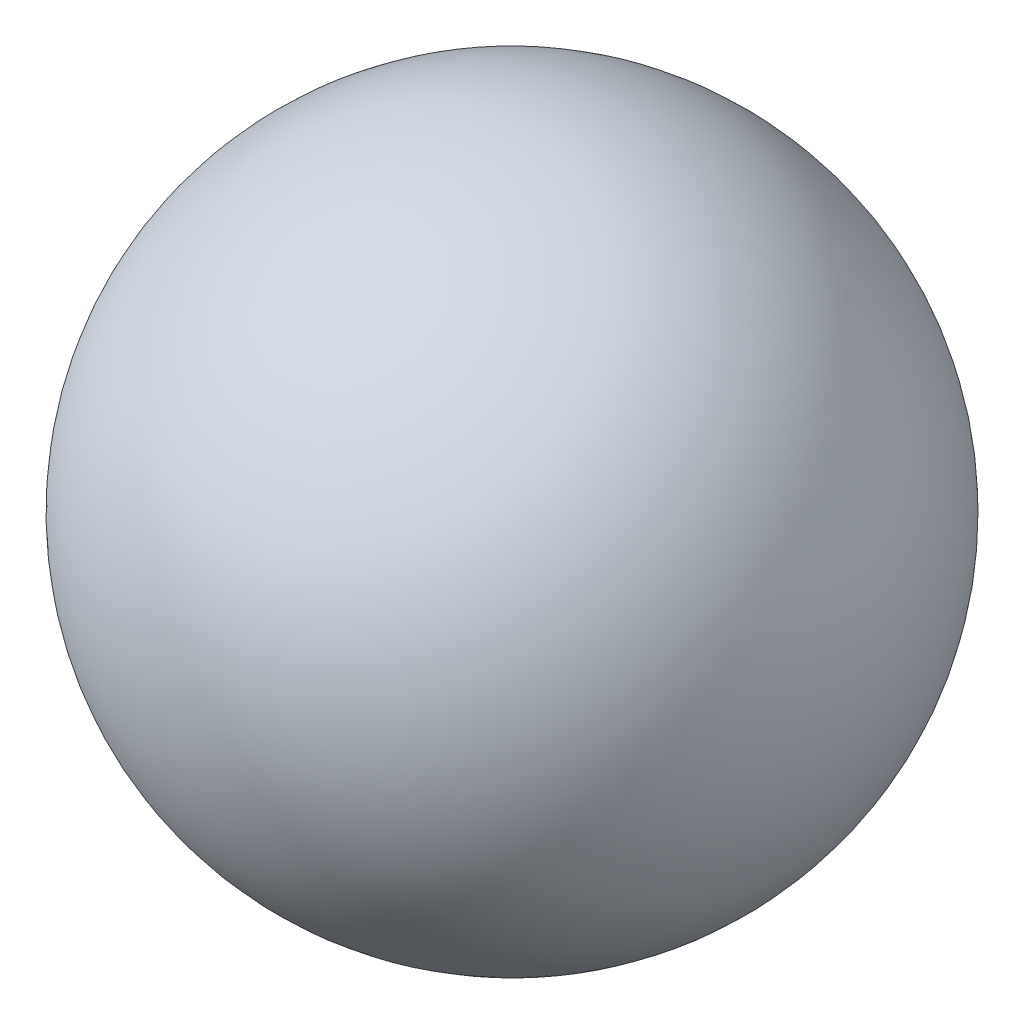
ISO-10303-21;
HEADER;
FILE_DESCRIPTION(('STEP AP214'),'2;1');
FILE_NAME('part.step','',(''),(''),'','','');
FILE_SCHEMA(('AUTOMOTIVE_DESIGN { 1 0 10303 214 1 1 1 1 }'));
ENDSEC;
DATA;
#1=APPLICATION_CONTEXT('core data for automotive mechanical design processes');
#2=APPLICATION_PROTOCOL_DEFINITION('international standard','automotive_design',2000,#1);
#3=PRODUCT_CONTEXT('',#1,'mechanical');
#4=PRODUCT('Part','Part','',(#3));
#5=PRODUCT_RELATED_PRODUCT_CATEGORY('part','',(#4));
#6=PRODUCT_DEFINITION_FORMATION('','',#4);
#7=PRODUCT_DEFINITION_CONTEXT('part definition',#1,'design');
#8=PRODUCT_DEFINITION('design','',#6,#7);
#9=PRODUCT_DEFINITION_SHAPE('','',#8);
#10=(LENGTH_UNIT() NAMED_UNIT(*) SI_UNIT(.MILLI.,.METRE.));
#11=(NAMED_UNIT(*) PLANE_ANGLE_UNIT() SI_UNIT($,.RADIAN.));
#12=(NAMED_UNIT(*) SI_UNIT($,.STERADIAN.) SOLID_ANGLE_UNIT());
#13=UNCERTAINTY_MEASURE_WITH_UNIT(LENGTH_MEASURE(1.E-05),#10,'distance_accuracy_value','');
#14=(GEOMETRIC_REPRESENTATION_CONTEXT(3) GLOBAL_UNCERTAINTY_ASSIGNED_CONTEXT((#13)) GLOBAL_UNIT_ASSIGNED_CONTEXT((#10,
#11,#12)) REPRESENTATION_CONTEXT('',''));
#15=CARTESIAN_POINT('',(0.,0.,0.));
#16=DIRECTION('',(0.,0.,1.));
#17=DIRECTION('',(1.,0.,0.));
#18=AXIS2_PLACEMENT_3D('',#15,#16,#17);
#19=CARTESIAN_POINT('',(57.535,61.3490751731812,4.73460321942238));
#20=DIRECTION('',(0.,0.997035261178115,0.0769460068326364));
#21=DIRECTION('',(0.173648177666934,-0.0757770240921106,0.981888055234759));
#22=AXIS2_PLACEMENT_3D('',#19,#20,#21);
#23=SPHERICAL_SURFACE('',#22,6.75);
#24=CARTESIAN_POINT('',(57.535,54.6190871602289,4.21521767330208));
#25=VERTEX_POINT('',#24);
#26=VERTEX_LOOP('',#25);
#27=FACE_BOUND('',#26,.T.);
#28=CARTESIAN_POINT('',(57.535,68.0790631861335,5.25398876554268));
#29=VERTEX_POINT('',#28);
#30=VERTEX_LOOP('',#29);
#31=FACE_BOUND('',#30,.T.);
#32=ADVANCED_FACE('F16',(#27,#31),#23,.T.);
#33=CLOSED_SHELL('',(#32));
#34=MANIFOLD_SOLID_BREP('B1',#33);
#35=ADVANCED_BREP_SHAPE_REPRESENTATION('',(#18,#34),#14);
#36=SHAPE_DEFINITION_REPRESENTATION(#9,#35);
ENDSEC;
END-ISO-10303-21;
